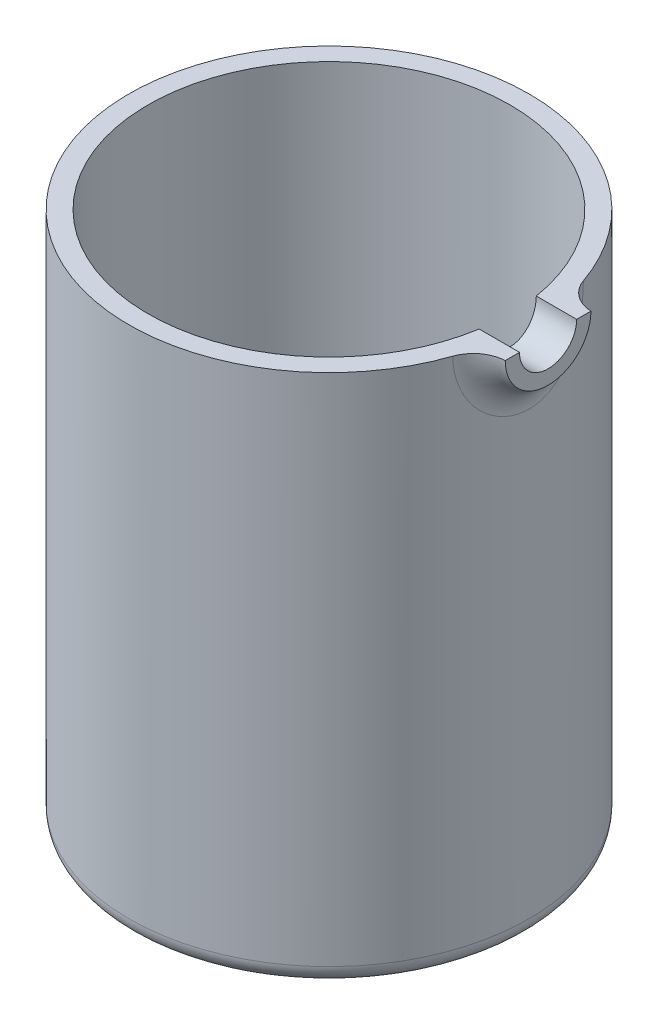
ISO-10303-21;
HEADER;
FILE_DESCRIPTION(('STEP AP214'),'2;1');
FILE_NAME('part.step','',(''),(''),'','','');
FILE_SCHEMA(('AUTOMOTIVE_DESIGN { 1 0 10303 214 1 1 1 1 }'));
ENDSEC;
DATA;
#1=APPLICATION_CONTEXT('core data for automotive mechanical design processes');
#2=APPLICATION_PROTOCOL_DEFINITION('international standard','automotive_design',2000,#1);
#3=PRODUCT_CONTEXT('',#1,'mechanical');
#4=PRODUCT('Part','Part','',(#3));
#5=PRODUCT_RELATED_PRODUCT_CATEGORY('part','',(#4));
#6=PRODUCT_DEFINITION_FORMATION('','',#4);
#7=PRODUCT_DEFINITION_CONTEXT('part definition',#1,'design');
#8=PRODUCT_DEFINITION('design','',#6,#7);
#9=PRODUCT_DEFINITION_SHAPE('','',#8);
#10=(LENGTH_UNIT() NAMED_UNIT(*) SI_UNIT(.MILLI.,.METRE.));
#11=(NAMED_UNIT(*) PLANE_ANGLE_UNIT() SI_UNIT($,.RADIAN.));
#12=(NAMED_UNIT(*) SI_UNIT($,.STERADIAN.) SOLID_ANGLE_UNIT());
#13=UNCERTAINTY_MEASURE_WITH_UNIT(LENGTH_MEASURE(1.E-05),#10,'distance_accuracy_value','');
#14=(GEOMETRIC_REPRESENTATION_CONTEXT(3) GLOBAL_UNCERTAINTY_ASSIGNED_CONTEXT((#13)) GLOBAL_UNIT_ASSIGNED_CONTEXT((#10,
#11,#12)) REPRESENTATION_CONTEXT('',''));
#15=CARTESIAN_POINT('',(0.,0.,0.));
#16=DIRECTION('',(0.,0.,1.));
#17=DIRECTION('',(1.,0.,0.));
#18=AXIS2_PLACEMENT_3D('',#15,#16,#17);
#19=CARTESIAN_POINT('',(0.,0.,0.));
#20=DIRECTION('',(0.,-1.,0.));
#21=DIRECTION('',(0.,0.,-1.));
#22=AXIS2_PLACEMENT_3D('',#19,#20,#21);
#23=CYLINDRICAL_SURFACE('',#22,21.);
#24=CARTESIAN_POINT('',(0.,2.,0.));
#25=DIRECTION('',(0.,-1.,0.));
#26=DIRECTION('',(0.,0.,-1.));
#27=AXIS2_PLACEMENT_3D('',#24,#25,#26);
#28=CIRCLE('',#27,21.);
#29=CARTESIAN_POINT('',(0.,2.,-21.));
#30=VERTEX_POINT('',#29);
#31=EDGE_CURVE('E119',#30,#30,#28,.F.);
#32=ORIENTED_EDGE('',*,*,#31,.T.);
#33=EDGE_LOOP('',(#32));
#34=FACE_BOUND('',#33,.T.);
#35=CARTESIAN_POINT('',(0.,56.,0.));
#36=DIRECTION('',(0.,-1.,0.));
#37=DIRECTION('',(0.,0.,-1.));
#38=AXIS2_PLACEMENT_3D('',#35,#36,#37);
#39=CIRCLE('',#38,21.);
#40=CARTESIAN_POINT('',(19.849979607856,56.,6.854072480482));
#41=VERTEX_POINT('',#40);
#42=CARTESIAN_POINT('',(19.8499796078562,56.,-6.85407248048209));
#43=VERTEX_POINT('',#42);
#44=EDGE_CURVE('E109',#41,#43,#39,.T.);
#45=ORIENTED_EDGE('',*,*,#44,.T.);
#46=CARTESIAN_POINT('',(23.,58.2430537206121,3.90111650767425));
#47=CARTESIAN_POINT('',(20.707786444559,58.7190716419978,4.01477908737872));
#48=CARTESIAN_POINT('',(20.1491447914274,59.9692255018648,5.91709085396665));
#49=CARTESIAN_POINT('',(23.,58.1402196157767,3.96025039529587));
#50=CARTESIAN_POINT('',(20.6999608269563,58.5939635905793,4.07396738846916));
#51=CARTESIAN_POINT('',(20.1217707549897,59.7895840556251,6.01027447529338));
#52=CARTESIAN_POINT('',(23.,58.0350117844223,4.01532489830903));
#53=CARTESIAN_POINT('',(20.6925886550047,58.466065332228,4.1289005903102));
#54=CARTESIAN_POINT('',(20.0956272406212,59.6050949216647,6.09693835125011));
#55=CARTESIAN_POINT('',(23.,57.8204558593593,4.11704063999823));
#56=CARTESIAN_POINT('',(20.6788529959974,58.2053402289708,4.23011824656942));
#57=CARTESIAN_POINT('',(20.0464448745581,59.2277917010585,6.25676742038335));
#58=CARTESIAN_POINT('',(23.,57.7111079246807,4.16368220220477));
#59=CARTESIAN_POINT('',(20.6724909470323,58.072524135629,4.27639126819044));
#60=CARTESIAN_POINT('',(20.023405903766,59.0349779341397,6.32993313142032));
#61=CARTESIAN_POINT('',(23.,57.4889696138292,4.2481846398736));
#62=CARTESIAN_POINT('',(20.6608913014206,57.8028593218342,4.36004727467573));
#63=CARTESIAN_POINT('',(19.9810928281341,58.6425560839523,6.46225515784014));
#64=CARTESIAN_POINT('',(23.,57.3761823788621,4.28605327124379));
#65=CARTESIAN_POINT('',(20.6556540720772,57.6660274374292,4.39742782520414));
#66=CARTESIAN_POINT('',(19.9618154002141,58.4429541823347,6.5214238485906));
#67=CARTESIAN_POINT('',(23.,57.147804902048,4.35278277329723));
#68=CARTESIAN_POINT('',(20.6463827469652,57.3891159506705,4.46317931695488));
#69=CARTESIAN_POINT('',(19.9275079201377,58.0383375466367,6.62551058674092));
#70=CARTESIAN_POINT('',(23.,57.0322147462018,4.3816439199776));
#71=CARTESIAN_POINT('',(20.6423497886534,57.249052246922,4.49154197135175));
#72=CARTESIAN_POINT('',(19.9124777378433,57.8333229786137,6.67042907078012));
#73=CARTESIAN_POINT('',(23.,56.6856571235589,4.45363474285054));
#74=CARTESIAN_POINT('',(20.6322606467463,56.8292536508658,4.56222178812165));
#75=CARTESIAN_POINT('',(19.874770020463,57.21829850295,6.78233146632501));
#76=CARTESIAN_POINT('',(23.,56.4514803462816,4.48346940860401));
#77=CARTESIAN_POINT('',(20.6280422984185,56.5460099461109,4.59134788687498));
#78=CARTESIAN_POINT('',(19.8588061561282,56.8022490943828,6.8284861874586));
#79=CARTESIAN_POINT('',(23.,55.9813100597998,4.50611859297299));
#80=CARTESIAN_POINT('',(20.6248411348821,55.9773503519113,4.61348438890509));
#81=CARTESIAN_POINT('',(19.8467130598608,55.9667972936324,6.86354594123543));
#82=CARTESIAN_POINT('',(23.,55.7453169201002,4.49894045225742));
#83=CARTESIAN_POINT('',(20.6258590824195,55.6920946831311,4.60648951533053));
#84=CARTESIAN_POINT('',(19.8505798949482,55.5473955827772,6.85246232583206));
#85=CARTESIAN_POINT('',(23.,55.2777182818181,4.4478768465836));
#86=CARTESIAN_POINT('',(20.6330610908486,55.1263481607244,4.55652765266584));
#87=CARTESIAN_POINT('',(19.8777174499586,54.7167267959535,6.77333636897829));
#88=CARTESIAN_POINT('',(23.,55.0461133287758,4.40398684782597));
#89=CARTESIAN_POINT('',(20.639241809873,54.8460121430103,4.51358388188091));
#90=CARTESIAN_POINT('',(19.9009905664953,54.3054607311338,6.70528699243418));
#91=CARTESIAN_POINT('',(23.,54.5933161998,4.2809257630275));
#92=CARTESIAN_POINT('',(20.6563802291348,54.2971431472554,4.39244129628911));
#93=CARTESIAN_POINT('',(19.9645833919613,53.5028457806397,6.51348802427678));
#94=CARTESIAN_POINT('',(23.,54.3721251814247,4.20175076508044));
#95=CARTESIAN_POINT('',(20.66732986279,54.0287369666593,4.31430068856757));
#96=CARTESIAN_POINT('',(20.0049049909619,53.11149910871,6.38973225670427));
#97=CARTESIAN_POINT('',(23.,53.9454370929876,4.01041413793299));
#98=CARTESIAN_POINT('',(20.6932956933603,53.5103581980626,4.12416508480476));
#99=CARTESIAN_POINT('',(20.0983782218066,52.360111567259,6.08931721705553));
#100=CARTESIAN_POINT('',(23.,53.7399287752313,3.89827643518));
#101=CARTESIAN_POINT('',(20.7082978045023,53.2604585961988,4.01228175367431));
#102=CARTESIAN_POINT('',(20.1515205425492,52.0000482350338,5.91269631619553));
#103=CARTESIAN_POINT('',(23.,53.3487172310578,3.64351393206026));
#104=CARTESIAN_POINT('',(20.741375044167,52.7846382692715,3.75643455120584));
#105=CARTESIAN_POINT('',(20.2650728454457,51.3208030925136,5.51091865375543));
#106=CARTESIAN_POINT('',(23.,53.1630098932736,3.50089547909893));
#107=CARTESIAN_POINT('',(20.759438105019,52.5587570603201,3.61258036468153));
#108=CARTESIAN_POINT('',(20.3254813133313,51.0016127927888,5.28577199724594));
#109=CARTESIAN_POINT('',(23.,52.8140478276308,3.18671757702491));
#110=CARTESIAN_POINT('',(20.7974163739129,52.1347370434981,3.2938946210771));
#111=CARTESIAN_POINT('',(20.4476573817046,50.4100735339229,4.79148762003162));
#112=CARTESIAN_POINT('',(23.,52.6509386183367,3.01498508325467));
#113=CARTESIAN_POINT('',(20.8173336010601,51.936773278085,3.11898313577711));
#114=CARTESIAN_POINT('',(20.5094310662796,50.1380255652804,4.52208718498043));
#115=CARTESIAN_POINT('',(23.,52.352301985013,2.64587685905826));
#116=CARTESIAN_POINT('',(20.8571056061118,51.5750899733172,2.74131419252542));
#117=CARTESIAN_POINT('',(20.6276798496163,49.6485874824216,3.94774783979974));
#118=CARTESIAN_POINT('',(23.,52.2167941464158,2.44848308143437));
#119=CARTESIAN_POINT('',(20.8769583735794,51.4113359004462,2.53862042766007));
#120=CARTESIAN_POINT('',(20.6841511707071,49.431236154377,3.64278393410214));
#121=CARTESIAN_POINT('',(23.,51.9736751219872,2.02491519531364));
#122=CARTESIAN_POINT('',(20.9148838063376,51.1183625039744,2.10219763616429));
#123=CARTESIAN_POINT('',(20.7879232576544,49.0482968259581,2.99552569937811));
#124=CARTESIAN_POINT('',(23.,51.8671331565634,1.798005843483));
#125=CARTESIAN_POINT('',(20.9328868476748,50.9903285465722,1.86766467523136));
#126=CARTESIAN_POINT('',(20.8348595258176,48.8846556181867,2.65233107608468));
#127=CARTESIAN_POINT('',(23.,51.6927291540129,1.32674641486045));
#128=CARTESIAN_POINT('',(20.9635245330466,50.781333231173,1.37949688382902));
#129=CARTESIAN_POINT('',(20.9125118621304,48.6206986819982,1.94734103946288));
#130=CARTESIAN_POINT('',(23.,51.6247908942493,1.08243178619694));
#131=CARTESIAN_POINT('',(20.9761888586323,50.7001288630635,1.12579495425934));
#132=CARTESIAN_POINT('',(20.9432598849266,48.5202581220954,1.58558382936692));
#133=CARTESIAN_POINT('',(23.,51.5687538883282,0.785167349994975));
#134=CARTESIAN_POINT('',(20.9867929385106,50.633248658119,0.816718719206154));
#135=CARTESIAN_POINT('',(20.9686941450266,48.4379767405494,1.14846809242138));
#136=CARTESIAN_POINT('',(23.,51.5604427348882,0.736714231327178));
#137=CARTESIAN_POINT('',(20.9883723734007,50.6233370496773,0.766350506971501));
#138=CARTESIAN_POINT('',(20.9724697476755,48.4257988595753,1.07731374235104));
#139=CARTESIAN_POINT('',(23.,51.5454003195313,0.639502403957035));
#140=CARTESIAN_POINT('',(20.9912425953028,50.6054031087571,0.665280880368683));
#141=CARTESIAN_POINT('',(20.9793094097851,48.4037979098955,0.934706516850464));
#142=CARTESIAN_POINT('',(23.,51.5386690119812,0.590743704123046));
#143=CARTESIAN_POINT('',(20.9925334960035,50.5973800476608,0.614577698722826));
#144=CARTESIAN_POINT('',(20.9823734897977,48.3939747731739,0.863253650103448));
#145=CARTESIAN_POINT('',(23.,51.4993601037795,0.266500502652708));
#146=CARTESIAN_POINT('',(21.0000778684047,50.5505543364209,0.277473599046344));
#147=CARTESIAN_POINT('',(21.000271628332,48.3366433075221,0.388517292184848));
#148=CARTESIAN_POINT('',(23.,51.491454497908,-0.0132305420632065));
#149=CARTESIAN_POINT('',(21.0016494149214,50.5411430238524,-0.0138689633239815));
#150=CARTESIAN_POINT('',(21.0038972136282,48.3252914164423,-0.019034661193624));
#151=CARTESIAN_POINT('',(23.,51.5273933259846,-0.568926637918834));
#152=CARTESIAN_POINT('',(20.9946909981474,50.5839435521396,-0.591992221665243));
#153=CARTESIAN_POINT('',(20.9875025513201,48.3775063435663,-0.830876366881392));
#154=CARTESIAN_POINT('',(23.,51.5713753755264,-0.844879701932761));
#155=CARTESIAN_POINT('',(20.9861250418567,50.6363751934509,-0.879135558965606));
#156=CARTESIAN_POINT('',(20.9674194237605,48.441272387677,-1.23515456806767));
#157=CARTESIAN_POINT('',(23.,51.7080531830485,-1.38034706930541));
#158=CARTESIAN_POINT('',(20.9608607645316,50.7996641844982,-1.43507413012421));
#159=CARTESIAN_POINT('',(20.9057059195354,48.6439645721177,-2.02695763726332));
#160=CARTESIAN_POINT('',(23.,51.8006171806539,-1.63990371896977));
#161=CARTESIAN_POINT('',(20.9441588270512,50.9105384682069,-1.70416561133998));
#162=CARTESIAN_POINT('',(20.8641338282422,48.7826874499377,-2.41452476610804));
#163=CARTESIAN_POINT('',(23.,52.0289541204239,-2.13423124924207));
#164=CARTESIAN_POINT('',(20.9060037577132,51.1848752836339,-2.21508374605538));
#165=CARTESIAN_POINT('',(20.7640965907371,49.1345587560181,-3.16135473268955));
#166=CARTESIAN_POINT('',(23.,52.1646848317558,-2.3690260571339));
#167=CARTESIAN_POINT('',(20.8845350144302,51.3484752037265,-2.45699544172589));
#168=CARTESIAN_POINT('',(20.7056479602963,49.3476344631886,-3.52064480764288));
#169=CARTESIAN_POINT('',(23.,52.467178230771,-2.79921040357795));
#170=CARTESIAN_POINT('',(20.8412278428964,51.7140919155084,-2.89854503979019));
#171=CARTESIAN_POINT('',(20.581375862021,49.8352899629665,-4.18531628661246));
#172=CARTESIAN_POINT('',(23.,52.632479276965,-2.99580205144511));
#173=CARTESIAN_POINT('',(20.8194337092237,51.9144310543168,-3.09943198677453));
#174=CARTESIAN_POINT('',(20.5159418242276,50.1070626834083,-4.49228108914285));
#175=CARTESIAN_POINT('',(23.,52.9924128663288,-3.35699259504564));
#176=CARTESIAN_POINT('',(20.7772185895872,52.3513974555041,-3.46696944382907));
#177=CARTESIAN_POINT('',(20.3836262211947,50.7107377324507,-5.05891431482502));
#178=CARTESIAN_POINT('',(23.,53.1870413647833,-3.52159589531669));
#179=CARTESIAN_POINT('',(20.7568064142911,52.5880453841939,-3.63349389042016));
#180=CARTESIAN_POINT('',(20.3167448566517,51.0426317706537,-5.3185892491004));
#181=CARTESIAN_POINT('',(23.,53.5896307951776,-3.80759446702171));
#182=CARTESIAN_POINT('',(20.7202437432717,53.0776648003147,-3.92147201386508));
#183=CARTESIAN_POINT('',(20.193130358981,51.7379688091022,-5.76969964146666));
#184=CARTESIAN_POINT('',(23.,53.7963104498213,-3.93083838083895));
#185=CARTESIAN_POINT('',(20.7039335800031,53.3290601405007,-4.04476550615587));
#186=CARTESIAN_POINT('',(20.1360447789901,52.0987525486004,-5.96405553611622));
#187=CARTESIAN_POINT('',(23.,54.2271575258015,-4.14302024406442));
#188=CARTESIAN_POINT('',(20.6753790956794,53.8527051038344,-4.25612564624549));
#189=CARTESIAN_POINT('',(20.0342145390462,52.8555784909476,-6.2976843989095));
#190=CARTESIAN_POINT('',(23.,54.4513203131609,-4.2319672471098));
#191=CARTESIAN_POINT('',(20.6631460671961,54.1248664353437,-4.34410231753593));
#192=CARTESIAN_POINT('',(19.9894666231086,53.2516113547726,-6.43697190415447));
#193=CARTESIAN_POINT('',(23.,54.9061008485559,-4.37133508282745));
#194=CARTESIAN_POINT('',(20.6438155825135,54.6763959172002,-4.48153224089159));
#195=CARTESIAN_POINT('',(19.9180881890147,54.0570304154953,-6.65451672636412));
#196=CARTESIAN_POINT('',(23.,55.1364236042024,-4.42265089808551));
#197=CARTESIAN_POINT('',(20.6366082897621,54.9553082764886,-4.53181335701167));
#198=CARTESIAN_POINT('',(19.8910385657266,54.4658474316669,-6.73419278583291));
#199=CARTESIAN_POINT('',(23.,55.6029800106324,-4.48862828726306));
#200=CARTESIAN_POINT('',(20.6273188182151,55.5199564773829,-4.59642599262667));
#201=CARTESIAN_POINT('',(19.8561094667656,55.2944753641475,-6.83651918277938));
#202=CARTESIAN_POINT('',(23.,55.8392146459512,-4.50328371435919));
#203=CARTESIAN_POINT('',(20.6252425866498,55.8055425065921,-4.61071594551494));
#204=CARTESIAN_POINT('',(19.8482332058837,55.7142881121816,-6.85915995719252));
#205=CARTESIAN_POINT('',(23.,56.1924936013775,-4.49742720884473));
#206=CARTESIAN_POINT('',(20.6260693707089,56.2327917787775,-4.6049861567894));
#207=CARTESIAN_POINT('',(19.8513501629403,56.3420568028355,-6.85008827337946));
#208=CARTESIAN_POINT('',(23.,56.3099763069615,-4.49085225434233));
#209=CARTESIAN_POINT('',(20.6269993398294,56.3748678690023,-4.59856588452328));
#210=CARTESIAN_POINT('',(19.854868512594,56.5508136404277,-6.83991876040139));
#211=CARTESIAN_POINT('',(23.,56.5440086749548,-4.46854000464656));
#212=CARTESIAN_POINT('',(20.6301479951449,56.6579907903589,-4.57674439736252));
#213=CARTESIAN_POINT('',(19.8667421438505,56.9665892284786,-6.80536052799244));
#214=CARTESIAN_POINT('',(23.,56.6605583324331,-4.45280266106389));
#215=CARTESIAN_POINT('',(20.6323662537467,56.7990182962039,-4.56134615398012));
#216=CARTESIAN_POINT('',(19.8750974509987,57.1736079697522,-6.78097173346532));
#217=CARTESIAN_POINT('',(23.,56.8919862692325,-4.41227518794655));
#218=CARTESIAN_POINT('',(20.6380603876445,57.0792012189659,-4.52161697780793));
#219=CARTESIAN_POINT('',(19.8964538412495,57.5844968115868,-6.71805444784962));
#220=CARTESIAN_POINT('',(23.,57.0068633893225,-4.387479063947));
#221=CARTESIAN_POINT('',(20.6415363356483,57.2183373457407,-4.49728548103625));
#222=CARTESIAN_POINT('',(19.9094580005136,57.7883647338329,-6.67951659382267));
#223=CARTESIAN_POINT('',(23.,57.2341626093701,-4.32904561484559));
#224=CARTESIAN_POINT('',(20.6496858452884,57.4938035853843,-4.4398039584965));
#225=CARTESIAN_POINT('',(19.9397515366175,58.19139282432,-6.58850885257547));
#226=CARTESIAN_POINT('',(23.,57.3465845587599,-4.29540774914799));
#227=CARTESIAN_POINT('',(20.6543584512885,57.6301174931801,-4.40666081126424));
#228=CARTESIAN_POINT('',(19.9570411754735,58.3905527038932,-6.53603811347824));
#229=CARTESIAN_POINT('',(23.,57.457419512922,-4.25745562083207));
#230=CARTESIAN_POINT('',(20.6596007141804,57.7646434010655,-4.3691599424435));
#231=CARTESIAN_POINT('',(19.9762929087103,58.5866366601394,-6.47670607835562));
#232=(BOUNDED_SURFACE() B_SPLINE_SURFACE(3,2,((#46,#47,#48),(#49,#50,#51),(#52,#53,#54),(#55,
#56,#57),(#58,#59,#60),(#61,#62,#63),(#64,#65,#66),(#67,#68,#69),(#70,#71,#72),(#73,#74,#75),
(#76,#77,#78),(#79,#80,#81),(#82,#83,#84),(#85,#86,#87),(#88,#89,#90),(#91,#92,#93),(#94,#95,
#96),(#97,#98,#99),(#100,#101,#102),(#103,#104,#105),(#106,#107,#108),(#109,#110,#111),(#112,
#113,#114),(#115,#116,#117),(#118,#119,#120),(#121,#122,#123),(#124,#125,#126),(#127,#128,#129),
(#130,#131,#132),(#133,#134,#135),(#136,#137,#138),(#139,#140,#141),(#142,#143,#144),(#145,#146,
#147),(#148,#149,#150),(#151,#152,#153),(#154,#155,#156),(#157,#158,#159),(#160,#161,#162),
(#163,#164,#165),(#166,#167,#168),(#169,#170,#171),(#172,#173,#174),(#175,#176,#177),(#178,#179,
#180),(#181,#182,#183),(#184,#185,#186),(#187,#188,#189),(#190,#191,#192),(#193,#194,#195),
(#196,#197,#198),(#199,#200,#201),(#202,#203,#204),(#205,#206,#207),(#208,#209,#210),(#211,#212,
#213),(#214,#215,#216),(#217,#218,#219),(#220,#221,#222),(#223,#224,#225),(#226,#227,#228),
(#229,#230,#231)),.UNSPECIFIED.,.F.,.F.,.F.) B_SPLINE_SURFACE_WITH_KNOTS((4,2,2,2,2,2,2,2,2,2,2,
2,2,2,2,2,2,2,2,2,2,2,2,2,2,2,2,2,2,2,4),(3,3),(0.,0.636961694320257,1.27389894636222,
1.91027093226943,2.54662341727421,3.79993314360266,5.05299431331713,6.30621025500902,
7.55956517029891,8.81201255724594,10.0641993843717,11.3241079678035,12.5849074687891,
13.8873497232146,15.1872113013645,15.439248639138,15.6912786960274,17.1104977347292,
18.5334892805522,19.9526412860175,21.3704091565122,22.7313582627846,24.0921198443537,
25.3796465754022,26.6668331943811,27.9223148408125,29.1780069789268,29.8048022292799,
30.4316007899545,31.058814875426,31.6860673185179),(0.,1.),
.UNSPECIFIED.) GEOMETRIC_REPRESENTATION_ITEM() RATIONAL_B_SPLINE_SURFACE(((1.,0.830893335285263,
1.),(1.,0.83054917798308,1.),(1.,0.830225751127018,1.),(1.,0.829623909166214,1.),(1.,
0.829345492334701,1.),(1.,0.828837419877027,1.),(1.,0.82860772119578,1.),(1.,0.82820036522652,
1.),(1.,0.828022706343972,1.),(1.,0.827577534227302,1.),(1.,0.82738989956195,1.),(1.,
0.827247755939451,1.),(1.,0.827293200756152,1.),(1.,0.827612494933749,1.),(1.,0.827886372505363,
1.),(1.,0.828639974284888,1.),(1.,0.829119721316501,1.),(1.,0.830256770454509,1.),(1.,
0.830913943745424,1.),(1.,0.832379639222052,1.),(1.,0.833188129892617,1.),(1.,0.834925815113262,
1.),(1.,0.835855723253306,1.),(1.,0.837761750710397,1.),(1.,0.838737902239711,1.),(1.,
0.840646585915544,1.),(1.,0.841576612475849,1.),(1.,0.843185188190292,1.),(1.,0.843864231973799,
1.),(1.,0.844436643924733,1.),(1.,0.844522103065879,1.),(1.,0.844677649105321,1.),(1.,
0.844747736447621,1.),(1.,0.845157744639521,1.),(1.,0.84524410315979,1.),(1.,0.844864840052037,
1.),(1.,0.84439775056389,1.),(1.,0.843045461651344,1.),(1.,0.842161393778982,1.),(1.,
0.840194580259087,1.),(1.,0.839112029228009,1.),(1.,0.83699209511926,1.),(1.,0.835954640569276,
1.),(1.,0.833994005944766,1.),(1.,0.833070810144098,1.),(1.,0.831440005638436,1.),(1.,
0.830723468272146,1.),(1.,0.829471825219074,1.),(1.,0.828936671655439,1.),(1.,0.828088052928444,
1.),(1.,0.827769451986031,1.),(1.,0.827358196747041,1.),(1.,0.827265580341207,1.),(1.,
0.827302247505453,1.),(1.,0.827343627063687,1.),(1.,0.827483367530058,1.),(1.,0.827581728739134,
1.),(1.,0.827833467951374,1.),(1.,0.827986882383703,1.),(1.,0.828345616602555,1.),(1.,
0.828550939562804,1.),(1.,0.828780656677998,1.))) REPRESENTATION_ITEM('') SURFACE());
#233=CARTESIAN_POINT('',(19.9762929087103,58.5866366601394,-6.47670607835562));
#234=CARTESIAN_POINT('',(19.9570411754735,58.3905527038932,-6.53603811347824));
#235=CARTESIAN_POINT('',(19.9397515366175,58.19139282432,-6.58850885257547));
#236=CARTESIAN_POINT('',(19.9094580005136,57.7883647338329,-6.67951659382267));
#237=CARTESIAN_POINT('',(19.8964538412495,57.5844968115868,-6.71805444784962));
#238=CARTESIAN_POINT('',(19.8750974509987,57.1736079697522,-6.78097173346532));
#239=CARTESIAN_POINT('',(19.8667421438505,56.9665892284786,-6.80536052799244));
#240=CARTESIAN_POINT('',(19.854868512594,56.5508136404277,-6.83991876040139));
#241=CARTESIAN_POINT('',(19.8513501629403,56.3420568028355,-6.85008827337946));
#242=CARTESIAN_POINT('',(19.8482332058837,55.7142881121816,-6.85915995719252));
#243=CARTESIAN_POINT('',(19.8561094667656,55.2944753641475,-6.83651918277938));
#244=CARTESIAN_POINT('',(19.8910385657266,54.4658474316669,-6.73419278583291));
#245=CARTESIAN_POINT('',(19.9180881890148,54.0570304154953,-6.65451672636412));
#246=CARTESIAN_POINT('',(19.9894666231086,53.2516113547726,-6.43697190415447));
#247=CARTESIAN_POINT('',(20.0342145390462,52.8555784909476,-6.2976843989095));
#248=CARTESIAN_POINT('',(20.1360447789901,52.0987525486004,-5.96405553611622));
#249=CARTESIAN_POINT('',(20.193130358981,51.7379688091022,-5.76969964146666));
#250=CARTESIAN_POINT('',(20.3167448566517,51.0426317706537,-5.3185892491004));
#251=CARTESIAN_POINT('',(20.3836262211947,50.7107377324507,-5.05891431482502));
#252=CARTESIAN_POINT('',(20.5159418242276,50.1070626834083,-4.49228108914285));
#253=CARTESIAN_POINT('',(20.581375862021,49.8352899629665,-4.18531628661246));
#254=CARTESIAN_POINT('',(20.7056479602963,49.3476344631886,-3.52064480764288));
#255=CARTESIAN_POINT('',(20.7640965907371,49.1345587560181,-3.16135473268955));
#256=CARTESIAN_POINT('',(20.8641338282422,48.7826874499377,-2.41452476610804));
#257=CARTESIAN_POINT('',(20.9057059195354,48.6439645721177,-2.02695763726331));
#258=CARTESIAN_POINT('',(20.9674194237605,48.441272387677,-1.23515456806767));
#259=CARTESIAN_POINT('',(20.9875025513202,48.3775063435663,-0.830876366881393));
#260=CARTESIAN_POINT('',(21.0038972136282,48.3252914164423,-0.0190346611936238));
#261=CARTESIAN_POINT('',(21.0002716283321,48.3366433075221,0.38851729218485));
#262=CARTESIAN_POINT('',(20.9823734897977,48.3939747731739,0.863253650103448));
#263=CARTESIAN_POINT('',(20.9793094097851,48.4037979098955,0.934706516850463));
#264=CARTESIAN_POINT('',(20.9724697476755,48.4257988595753,1.07731374235104));
#265=CARTESIAN_POINT('',(20.9686941450266,48.4379767405495,1.14846809242138));
#266=CARTESIAN_POINT('',(20.9432598849266,48.5202581220954,1.58558382936693));
#267=CARTESIAN_POINT('',(20.9125118621304,48.6206986819982,1.94734103946288));
#268=CARTESIAN_POINT('',(20.8348595258176,48.8846556181867,2.65233107608468));
#269=CARTESIAN_POINT('',(20.7879232576544,49.0482968259581,2.99552569937811));
#270=CARTESIAN_POINT('',(20.6841511707071,49.431236154377,3.64278393410214));
#271=CARTESIAN_POINT('',(20.6276798496163,49.6485874824216,3.94774783979974));
#272=CARTESIAN_POINT('',(20.5094310662796,50.1380255652804,4.52208718498043));
#273=CARTESIAN_POINT('',(20.4476573817046,50.4100735339229,4.79148762003162));
#274=CARTESIAN_POINT('',(20.3254813133313,51.0016127927888,5.28577199724594));
#275=CARTESIAN_POINT('',(20.2650728454457,51.3208030925136,5.51091865375543));
#276=CARTESIAN_POINT('',(20.1515205425492,52.0000482350338,5.91269631619553));
#277=CARTESIAN_POINT('',(20.0983782218066,52.360111567259,6.08931721705553));
#278=CARTESIAN_POINT('',(20.0049049909619,53.11149910871,6.38973225670427));
#279=CARTESIAN_POINT('',(19.9645833919613,53.5028457806397,6.51348802427678));
#280=CARTESIAN_POINT('',(19.9009905664953,54.3054607311338,6.70528699243418));
#281=CARTESIAN_POINT('',(19.8777174499586,54.7167267959535,6.77333636897829));
#282=CARTESIAN_POINT('',(19.8505798949482,55.5473955827772,6.85246232583206));
#283=CARTESIAN_POINT('',(19.8467130598608,55.9667972936325,6.86354594123543));
#284=CARTESIAN_POINT('',(19.8588061561282,56.8022490943828,6.8284861874586));
#285=CARTESIAN_POINT('',(19.874770020463,57.21829850295,6.78233146632501));
#286=CARTESIAN_POINT('',(19.9124777378433,57.8333229786137,6.67042907078012));
#287=CARTESIAN_POINT('',(19.9275079201377,58.0383375466367,6.62551058674092));
#288=CARTESIAN_POINT('',(19.9618154002141,58.4429541823347,6.5214238485906));
#289=CARTESIAN_POINT('',(19.9810928281341,58.6425560839523,6.46225515784014));
#290=CARTESIAN_POINT('',(20.023405903766,59.0349779341397,6.32993313142032));
#291=CARTESIAN_POINT('',(20.0464448745581,59.2277917010585,6.25676742038335));
#292=CARTESIAN_POINT('',(20.0956272406212,59.6050949216647,6.09693835125011));
#293=CARTESIAN_POINT('',(20.1217707549897,59.7895840556251,6.01027447529338));
#294=CARTESIAN_POINT('',(20.1491447914274,59.9692255018648,5.91709085396665));
#295=B_SPLINE_CURVE_WITH_KNOTS('',3,(#233,#234,#235,#236,#237,#238,#239,#240,#241,#242,#243,
#244,#245,#246,#247,#248,#249,#250,#251,#252,#253,#254,#255,#256,#257,#258,#259,#260,#261,#262,
#263,#264,#265,#266,#267,#268,#269,#270,#271,#272,#273,#274,#275,#276,#277,#278,#279,#280,#281,
#282,#283,#284,#285,#286,#287,#288,#289,#290,#291,#292,#293,#294),.UNSPECIFIED.,.F.,.F.,(4,2,2,
2,2,2,2,2,2,2,2,2,2,2,2,2,2,2,2,2,2,2,2,2,2,2,2,2,2,2,4),(0.,0.627252443091877,1.25446652856341,
1.88126508923797,2.50806033959106,3.76375247770535,5.01923412413676,6.30642074311567,
7.59394747416417,8.95470905573329,10.3156581620057,11.7334260325004,13.1525780379657,
14.5755695837887,15.9947886224905,16.2468186793798,16.4988560171534,17.7987175953033,
19.1011598497288,20.3619593507144,21.6218679341462,22.874054761272,24.126502148219,
25.3798570635089,26.6330730052008,27.8861341749152,29.1394439012437,29.7757963862485,
30.4121683721557,31.0491056241976,31.6860673185179),.UNSPECIFIED.);
#296=EDGE_CURVE('E122',#43,#41,#295,.T.);
#297=ORIENTED_EDGE('',*,*,#296,.T.);
#298=EDGE_LOOP('',(#45,#297));
#299=FACE_BOUND('',#298,.T.);
#300=ADVANCED_FACE('F41',(#34,#299),#23,.T.);
#301=CARTESIAN_POINT('',(0.,2.,0.));
#302=DIRECTION('',(0.,1.,0.));
#303=DIRECTION('',(0.,0.,1.));
#304=AXIS2_PLACEMENT_3D('',#301,#302,#303);
#305=PLANE('',#304);
#306=CARTESIAN_POINT('',(0.,2.,0.));
#307=DIRECTION('',(0.,-1.,0.));
#308=DIRECTION('',(0.,0.,-1.));
#309=AXIS2_PLACEMENT_3D('',#306,#307,#308);
#310=CIRCLE('',#309,19.);
#311=CARTESIAN_POINT('',(0.,2.,-19.));
#312=VERTEX_POINT('',#311);
#313=EDGE_CURVE('E108',#312,#312,#310,.T.);
#314=ORIENTED_EDGE('',*,*,#313,.F.);
#315=EDGE_LOOP('',(#314));
#316=FACE_BOUND('',#315,.T.);
#317=ADVANCED_FACE('F137',(#316),#305,.T.);
#318=CARTESIAN_POINT('',(0.,0.,0.));
#319=DIRECTION('',(0.,-1.,0.));
#320=DIRECTION('',(0.,0.,-1.));
#321=AXIS2_PLACEMENT_3D('',#318,#319,#320);
#322=CYLINDRICAL_SURFACE('',#321,19.);
#323=CARTESIAN_POINT('',(18.7616630392938,56.,3.));
#324=CARTESIAN_POINT('',(18.761657423998,55.9161825604073,3.00000869502194));
#325=CARTESIAN_POINT('',(18.7622245982653,55.8323696771555,2.99648739376202));
#326=CARTESIAN_POINT('',(18.7644629923588,55.6653539891527,2.98245218505678));
#327=CARTESIAN_POINT('',(18.7661341076855,55.5821511274105,2.97193893947112));
#328=CARTESIAN_POINT('',(18.7705361931051,55.4170405718178,2.94400415988908));
#329=CARTESIAN_POINT('',(18.7732658749571,55.3351314291674,2.92659102227856));
#330=CARTESIAN_POINT('',(18.7797012860914,55.1731103478566,2.8850057810227));
#331=CARTESIAN_POINT('',(18.7834070132543,55.0929984052939,2.86083369205501));
#332=CARTESIAN_POINT('',(18.7958404034488,54.8561636732071,2.7784023518532));
#333=CARTESIAN_POINT('',(18.8058873473559,54.7028343969563,2.71020970070203));
#334=CARTESIAN_POINT('',(18.8283581111186,54.4098777359917,2.54940708876377));
#335=CARTESIAN_POINT('',(18.8407819114043,54.2702502384775,2.4567973290147));
#336=CARTESIAN_POINT('',(18.8667293195783,54.0073305997954,2.2489010245305));
#337=CARTESIAN_POINT('',(18.8802607659226,53.8841746927486,2.13344286443404));
#338=CARTESIAN_POINT('',(18.9068301208734,53.6588938853749,1.88349157660652));
#339=CARTESIAN_POINT('',(18.9198679537061,53.5567722033781,1.74899554129947));
#340=CARTESIAN_POINT('',(18.9440630322152,53.3759533603582,1.46390510014253));
#341=CARTESIAN_POINT('',(18.9552099031093,53.297383720902,1.31322884984651));
#342=CARTESIAN_POINT('',(18.9742785910654,53.1667245338712,1.00062131516933));
#343=CARTESIAN_POINT('',(18.982200781593,53.1146319196928,0.838691336680375));
#344=CARTESIAN_POINT('',(18.9938725255218,53.0388183521606,0.509588402359973));
#345=CARTESIAN_POINT('',(18.9976561038329,53.0148659261868,0.342469996530402));
#346=CARTESIAN_POINT('',(19.0007411053238,52.9952934695699,0.00654223245900797));
#347=CARTESIAN_POINT('',(19.0000426964357,52.9996723774024,-0.16226706219162));
#348=CARTESIAN_POINT('',(18.9942693178939,53.0364575992912,-0.495195123577629));
#349=CARTESIAN_POINT('',(18.9892333610299,53.0686140836582,-0.659342266961306));
#350=CARTESIAN_POINT('',(18.9753942524631,53.1596487577638,-0.97988016224216));
#351=CARTESIAN_POINT('',(18.9665910186345,53.2185275300441,-1.1362707449651));
#352=CARTESIAN_POINT('',(18.9461395429065,53.3615888432726,-1.43760997717451));
#353=CARTESIAN_POINT('',(18.9344795785375,53.4458759833157,-1.58250813977254));
#354=CARTESIAN_POINT('',(18.9096129160728,53.637281867234,-1.85619267268509));
#355=CARTESIAN_POINT('',(18.8964061646893,53.7444013978042,-1.98497848760237));
#356=CARTESIAN_POINT('',(18.8697482716008,53.9798037236421,-2.224247260321));
#357=CARTESIAN_POINT('',(18.8562960297529,54.1083020463587,-2.33451813106786));
#358=CARTESIAN_POINT('',(18.8307975969792,54.3821358716989,-2.53199745921619));
#359=CARTESIAN_POINT('',(18.8187518109854,54.5274761994154,-2.61919928392273));
#360=CARTESIAN_POINT('',(18.7974283233195,54.831121155361,-2.76809987118414));
#361=CARTESIAN_POINT('',(18.7881548051623,54.9894449221699,-2.82976014356916));
#362=CARTESIAN_POINT('',(18.7734929089433,55.3142710955122,-2.92546538419852));
#363=CARTESIAN_POINT('',(18.7680987156027,55.4807608589359,-2.95955169663892));
#364=CARTESIAN_POINT('',(18.763857615587,55.707084244195,-2.98624689727121));
#365=CARTESIAN_POINT('',(18.763035347921,55.7655973407484,-2.99140653790593));
#366=CARTESIAN_POINT('',(18.7619386344572,55.8827318227603,-2.99827856784796));
#367=CARTESIAN_POINT('',(18.7616632674623,55.9413528593666,-2.99999675396858));
#368=CARTESIAN_POINT('',(18.7616630392937,56.,-3.));
#369=B_SPLINE_CURVE_WITH_KNOTS('',3,(#323,#324,#325,#326,#327,#328,#329,#330,#331,#332,#333,
#334,#335,#336,#337,#338,#339,#340,#341,#342,#343,#344,#345,#346,#347,#348,#349,#350,#351,#352,
#353,#354,#355,#356,#357,#358,#359,#360,#361,#362,#363,#364,#365,#366,#367,#368),.UNSPECIFIED.,
.F.,.F.,(4,2,2,2,2,2,2,2,2,2,2,2,2,2,2,2,2,2,2,2,2,2,4),(0.,0.251368417545015,0.502713043862153,
0.753752746984636,1.00479190495728,1.506546817345,2.00829759866743,2.51397079978333,
3.01972131377174,3.52816268515553,4.03654515476634,4.54071587685663,5.04486770868407,
5.54453189105402,6.04420696654675,6.5459678261021,7.04774597673578,7.55492892186489,
8.06225753156424,8.57034790945301,9.07767504084734,9.25383551157105,9.42969900582089),.UNSPECIFIED.);
#370=CARTESIAN_POINT('',(18.7616630392938,56.,3.));
#371=VERTEX_POINT('',#370);
#372=CARTESIAN_POINT('',(18.7616630392937,56.,-3.));
#373=VERTEX_POINT('',#372);
#374=EDGE_CURVE('E92',#371,#373,#369,.T.);
#375=ORIENTED_EDGE('',*,*,#374,.T.);
#376=CARTESIAN_POINT('',(0.,56.,0.));
#377=DIRECTION('',(0.,-1.,0.));
#378=DIRECTION('',(0.,0.,-1.));
#379=AXIS2_PLACEMENT_3D('',#376,#377,#378);
#380=CIRCLE('',#379,19.);
#381=EDGE_CURVE('E103',#371,#373,#380,.T.);
#382=ORIENTED_EDGE('',*,*,#381,.F.);
#383=EDGE_LOOP('',(#375,#382));
#384=FACE_BOUND('',#383,.T.);
#385=ORIENTED_EDGE('',*,*,#313,.T.);
#386=EDGE_LOOP('',(#385));
#387=FACE_BOUND('',#386,.T.);
#388=ADVANCED_FACE('F101',(#384,#387),#322,.F.);
#389=CARTESIAN_POINT('',(19.,56.,-1.11022302462516E-13));
#390=DIRECTION('',(0.,1.,0.));
#391=DIRECTION('',(0.,0.,1.));
#392=AXIS2_PLACEMENT_3D('',#389,#390,#391);
#393=PLANE('',#392);
#394=DIRECTION('',(-1.,0.,0.));
#395=VECTOR('',#394,1.);
#396=CARTESIAN_POINT('',(19.0000000000001,56.,2.99999999999989));
#397=LINE('',#396,#395);
#398=CARTESIAN_POINT('',(23.0000000000001,56.,3.));
#399=VERTEX_POINT('',#398);
#400=EDGE_CURVE('E107',#399,#371,#397,.T.);
#401=ORIENTED_EDGE('',*,*,#400,.T.);
#402=ORIENTED_EDGE('',*,*,#381,.T.);
#403=DIRECTION('',(-1.,0.,0.));
#404=VECTOR('',#403,1.);
#405=CARTESIAN_POINT('',(19.0000000000001,56.,-3.00000000000009));
#406=LINE('',#405,#404);
#407=CARTESIAN_POINT('',(23.0000000000001,56.,-3.00000000000009));
#408=VERTEX_POINT('',#407);
#409=EDGE_CURVE('E88',#408,#373,#406,.T.);
#410=ORIENTED_EDGE('',*,*,#409,.F.);
#411=DIRECTION('',(0.,0.,1.));
#412=VECTOR('',#411,1.);
#413=CARTESIAN_POINT('',(23.0000000000001,56.,-3.00000000000009));
#414=LINE('',#413,#412);
#415=CARTESIAN_POINT('',(23.0000000000002,56.,-4.50000000000009));
#416=VERTEX_POINT('',#415);
#417=EDGE_CURVE('E98',#416,#408,#414,.T.);
#418=ORIENTED_EDGE('',*,*,#417,.F.);
#419=CARTESIAN_POINT('',(23.1583095424987,56.,-7.99641789389571));
#420=DIRECTION('',(0.,1.,0.));
#421=DIRECTION('',(0.,0.,1.));
#422=AXIS2_PLACEMENT_3D('',#419,#420,#421);
#423=CIRCLE('',#422,3.5);
#424=EDGE_CURVE('E11',#416,#43,#423,.F.);
#425=ORIENTED_EDGE('',*,*,#424,.T.);
#426=ORIENTED_EDGE('',*,*,#44,.F.);
#427=CARTESIAN_POINT('',(23.1583095424987,56.,7.9964178938956));
#428=DIRECTION('',(0.,1.,0.));
#429=DIRECTION('',(0.,0.,1.));
#430=AXIS2_PLACEMENT_3D('',#427,#428,#429);
#431=CIRCLE('',#430,3.5);
#432=CARTESIAN_POINT('',(23.0000000000001,56.,4.49999999999995));
#433=VERTEX_POINT('',#432);
#434=EDGE_CURVE('E54',#41,#433,#431,.F.);
#435=ORIENTED_EDGE('',*,*,#434,.T.);
#436=DIRECTION('',(0.,0.,-1.));
#437=VECTOR('',#436,1.);
#438=CARTESIAN_POINT('',(23.0000000000001,56.,3.));
#439=LINE('',#438,#437);
#440=EDGE_CURVE('E97',#433,#399,#439,.T.);
#441=ORIENTED_EDGE('',*,*,#440,.T.);
#442=EDGE_LOOP('',(#401,#402,#410,#418,#425,#426,#435,#441));
#443=FACE_BOUND('',#442,.T.);
#444=ADVANCED_FACE('F105',(#443),#393,.T.);
#445=CARTESIAN_POINT('',(21.0000000000001,0.,0.));
#446=DIRECTION('',(0.,-1.,0.));
#447=DIRECTION('',(0.,0.,-1.));
#448=AXIS2_PLACEMENT_3D('',#445,#446,#447);
#449=PLANE('',#448);
#450=CARTESIAN_POINT('',(0.,0.,0.));
#451=DIRECTION('',(0.,-1.,0.));
#452=DIRECTION('',(0.,0.,-1.));
#453=AXIS2_PLACEMENT_3D('',#450,#451,#452);
#454=CIRCLE('',#453,19.);
#455=CARTESIAN_POINT('',(0.,0.,-19.));
#456=VERTEX_POINT('',#455);
#457=EDGE_CURVE('E112',#456,#456,#454,.T.);
#458=ORIENTED_EDGE('',*,*,#457,.T.);
#459=EDGE_LOOP('',(#458));
#460=FACE_BOUND('',#459,.T.);
#461=ADVANCED_FACE('F139',(#460),#449,.T.);
#462=CARTESIAN_POINT('',(0.,2.,0.));
#463=DIRECTION('',(0.,-1.,0.));
#464=DIRECTION('',(0.,0.,-1.));
#465=AXIS2_PLACEMENT_3D('',#462,#463,#464);
#466=TOROIDAL_SURFACE('',#465,19.,2.);
#467=ORIENTED_EDGE('',*,*,#31,.F.);
#468=EDGE_LOOP('',(#467));
#469=FACE_BOUND('',#468,.T.);
#470=ORIENTED_EDGE('',*,*,#457,.F.);
#471=EDGE_LOOP('',(#470));
#472=FACE_BOUND('',#471,.T.);
#473=ADVANCED_FACE('F159',(#469,#472),#466,.T.);
#474=CARTESIAN_POINT('',(21.,56.,-1.11022302462516E-13));
#475=DIRECTION('',(1.,0.,0.));
#476=DIRECTION('',(0.,0.,-1.));
#477=AXIS2_PLACEMENT_3D('',#474,#475,#476);
#478=CYLINDRICAL_SURFACE('',#477,3.);
#479=ORIENTED_EDGE('',*,*,#409,.T.);
#480=ORIENTED_EDGE('',*,*,#374,.F.);
#481=ORIENTED_EDGE('',*,*,#400,.F.);
#482=CARTESIAN_POINT('',(23.,56.,0.));
#483=DIRECTION('',(1.,0.,0.));
#484=DIRECTION('',(0.,0.,-1.));
#485=AXIS2_PLACEMENT_3D('',#482,#483,#484);
#486=CIRCLE('',#485,3.);
#487=EDGE_CURVE('E94',#399,#408,#486,.T.);
#488=ORIENTED_EDGE('',*,*,#487,.T.);
#489=EDGE_LOOP('',(#479,#480,#481,#488));
#490=FACE_BOUND('',#489,.T.);
#491=ADVANCED_FACE('F90',(#490),#478,.F.);
#492=CARTESIAN_POINT('',(23.0000000000001,56.,3.));
#493=DIRECTION('',(-1.,0.,0.));
#494=DIRECTION('',(0.,0.,1.));
#495=AXIS2_PLACEMENT_3D('',#492,#493,#494);
#496=PLANE('',#495);
#497=ORIENTED_EDGE('',*,*,#440,.F.);
#498=CARTESIAN_POINT('',(23.,56.,0.));
#499=DIRECTION('',(1.,0.,0.));
#500=DIRECTION('',(0.,0.,-1.));
#501=AXIS2_PLACEMENT_3D('',#498,#499,#500);
#502=CIRCLE('',#501,4.5);
#503=EDGE_CURVE('E237',#433,#416,#502,.T.);
#504=ORIENTED_EDGE('',*,*,#503,.T.);
#505=ORIENTED_EDGE('',*,*,#417,.T.);
#506=ORIENTED_EDGE('',*,*,#487,.F.);
#507=EDGE_LOOP('',(#497,#504,#505,#506));
#508=FACE_BOUND('',#507,.T.);
#509=ADVANCED_FACE('F147',(#508),#496,.F.);
#510=ORIENTED_EDGE('',*,*,#424,.F.);
#511=ORIENTED_EDGE('',*,*,#503,.F.);
#512=ORIENTED_EDGE('',*,*,#434,.F.);
#513=ORIENTED_EDGE('',*,*,#296,.F.);
#514=EDGE_LOOP('',(#510,#511,#512,#513));
#515=FACE_BOUND('',#514,.T.);
#516=ADVANCED_FACE('F143',(#515),#232,.F.);
#517=CLOSED_SHELL('',(#300,#317,#388,#444,#461,#473,#491,#509,#516));
#518=MANIFOLD_SOLID_BREP('B2',#517);
#519=ADVANCED_BREP_SHAPE_REPRESENTATION('',(#18,#518),#14);
#520=SHAPE_DEFINITION_REPRESENTATION(#9,#519);
ENDSEC;
END-ISO-10303-21;
